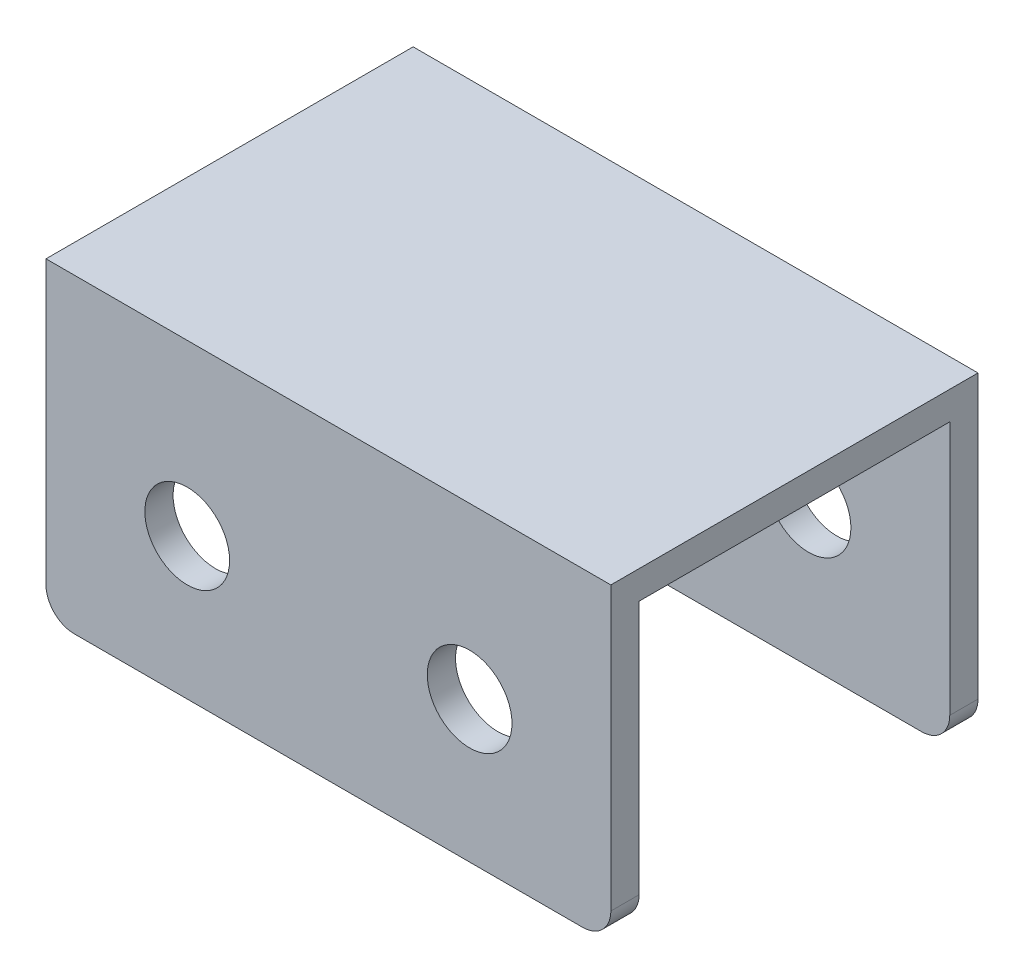
ISO-10303-21;
HEADER;
FILE_DESCRIPTION(('STEP AP214'),'2;1');
FILE_NAME('part.step','',(''),(''),'','','');
FILE_SCHEMA(('AUTOMOTIVE_DESIGN { 1 0 10303 214 1 1 1 1 }'));
ENDSEC;
DATA;
#1=APPLICATION_CONTEXT('core data for automotive mechanical design processes');
#2=APPLICATION_PROTOCOL_DEFINITION('international standard','automotive_design',2000,#1);
#3=PRODUCT_CONTEXT('',#1,'mechanical');
#4=PRODUCT('Part','Part','',(#3));
#5=PRODUCT_RELATED_PRODUCT_CATEGORY('part','',(#4));
#6=PRODUCT_DEFINITION_FORMATION('','',#4);
#7=PRODUCT_DEFINITION_CONTEXT('part definition',#1,'design');
#8=PRODUCT_DEFINITION('design','',#6,#7);
#9=PRODUCT_DEFINITION_SHAPE('','',#8);
#10=(LENGTH_UNIT() NAMED_UNIT(*) SI_UNIT(.MILLI.,.METRE.));
#11=(NAMED_UNIT(*) PLANE_ANGLE_UNIT() SI_UNIT($,.RADIAN.));
#12=(NAMED_UNIT(*) SI_UNIT($,.STERADIAN.) SOLID_ANGLE_UNIT());
#13=UNCERTAINTY_MEASURE_WITH_UNIT(LENGTH_MEASURE(1.E-05),#10,'distance_accuracy_value','');
#14=(GEOMETRIC_REPRESENTATION_CONTEXT(3) GLOBAL_UNCERTAINTY_ASSIGNED_CONTEXT((#13)) GLOBAL_UNIT_ASSIGNED_CONTEXT((#10,
#11,#12)) REPRESENTATION_CONTEXT('',''));
#15=CARTESIAN_POINT('',(0.,0.,0.));
#16=DIRECTION('',(0.,0.,1.));
#17=DIRECTION('',(1.,0.,0.));
#18=AXIS2_PLACEMENT_3D('',#15,#16,#17);
#19=CARTESIAN_POINT('',(50.,0.,-27.5));
#20=DIRECTION('',(0.,0.,-1.));
#21=DIRECTION('',(0.,1.,0.));
#22=AXIS2_PLACEMENT_3D('',#19,#20,#21);
#23=PLANE('',#22);
#24=CARTESIAN_POINT('',(25.,-25.,-27.5));
#25=DIRECTION('',(0.,0.,-1.));
#26=DIRECTION('',(0.,1.,0.));
#27=AXIS2_PLACEMENT_3D('',#24,#25,#26);
#28=CIRCLE('',#27,7.5);
#29=CARTESIAN_POINT('',(25.,-17.5,-27.5));
#30=VERTEX_POINT('',#29);
#31=EDGE_CURVE('E197',#30,#30,#28,.T.);
#32=ORIENTED_EDGE('',*,*,#31,.T.);
#33=EDGE_LOOP('',(#32));
#34=FACE_BOUND('',#33,.T.);
#35=CARTESIAN_POINT('',(-25.,-25.,-27.5));
#36=DIRECTION('',(0.,0.,-1.));
#37=DIRECTION('',(0.,1.,0.));
#38=AXIS2_PLACEMENT_3D('',#35,#36,#37);
#39=CIRCLE('',#38,7.5);
#40=CARTESIAN_POINT('',(-25.,-17.5,-27.5));
#41=VERTEX_POINT('',#40);
#42=EDGE_CURVE('E164',#41,#41,#39,.T.);
#43=ORIENTED_EDGE('',*,*,#42,.T.);
#44=EDGE_LOOP('',(#43));
#45=FACE_BOUND('',#44,.T.);
#46=DIRECTION('',(-1.,0.,0.));
#47=VECTOR('',#46,1.);
#48=CARTESIAN_POINT('',(50.,-50.,-27.5));
#49=LINE('',#48,#47);
#50=CARTESIAN_POINT('',(45.,-50.,-27.5));
#51=VERTEX_POINT('',#50);
#52=CARTESIAN_POINT('',(-45.,-50.,-27.5));
#53=VERTEX_POINT('',#52);
#54=EDGE_CURVE('E186',#51,#53,#49,.T.);
#55=ORIENTED_EDGE('',*,*,#54,.F.);
#56=CARTESIAN_POINT('',(45.,-45.,-27.5));
#57=DIRECTION('',(0.,0.,-1.));
#58=DIRECTION('',(0.,1.,0.));
#59=AXIS2_PLACEMENT_3D('',#56,#57,#58);
#60=CIRCLE('',#59,5.);
#61=CARTESIAN_POINT('',(50.,-45.,-27.5));
#62=VERTEX_POINT('',#61);
#63=EDGE_CURVE('E205',#51,#62,#60,.F.);
#64=ORIENTED_EDGE('',*,*,#63,.T.);
#65=DIRECTION('',(0.,-1.,0.));
#66=VECTOR('',#65,1.);
#67=CARTESIAN_POINT('',(50.,0.,-27.5));
#68=LINE('',#67,#66);
#69=CARTESIAN_POINT('',(50.,0.,-27.5));
#70=VERTEX_POINT('',#69);
#71=EDGE_CURVE('E146',#70,#62,#68,.T.);
#72=ORIENTED_EDGE('',*,*,#71,.F.);
#73=DIRECTION('',(-1.,0.,0.));
#74=VECTOR('',#73,1.);
#75=CARTESIAN_POINT('',(50.,0.,-27.5));
#76=LINE('',#75,#74);
#77=CARTESIAN_POINT('',(-50.,0.,-27.5));
#78=VERTEX_POINT('',#77);
#79=EDGE_CURVE('E160',#70,#78,#76,.T.);
#80=ORIENTED_EDGE('',*,*,#79,.T.);
#81=DIRECTION('',(0.,-1.,0.));
#82=VECTOR('',#81,1.);
#83=CARTESIAN_POINT('',(-50.,0.,-27.5));
#84=LINE('',#83,#82);
#85=CARTESIAN_POINT('',(-50.,-45.,-27.5));
#86=VERTEX_POINT('',#85);
#87=EDGE_CURVE('E161',#78,#86,#84,.T.);
#88=ORIENTED_EDGE('',*,*,#87,.T.);
#89=CARTESIAN_POINT('',(-45.,-45.,-27.5));
#90=DIRECTION('',(0.,0.,-1.));
#91=DIRECTION('',(0.,1.,0.));
#92=AXIS2_PLACEMENT_3D('',#89,#90,#91);
#93=CIRCLE('',#92,5.);
#94=EDGE_CURVE('E203',#86,#53,#93,.F.);
#95=ORIENTED_EDGE('',*,*,#94,.T.);
#96=EDGE_LOOP('',(#55,#64,#72,#80,#88,#95));
#97=FACE_BOUND('',#96,.T.);
#98=ADVANCED_FACE('F35',(#34,#45,#97),#23,.F.);
#99=CARTESIAN_POINT('',(50.,-50.,-32.5));
#100=DIRECTION('',(0.,-1.,0.));
#101=DIRECTION('',(0.,0.,-1.));
#102=AXIS2_PLACEMENT_3D('',#99,#100,#101);
#103=PLANE('',#102);
#104=DIRECTION('',(-1.,0.,0.));
#105=VECTOR('',#104,1.);
#106=CARTESIAN_POINT('',(50.,-50.,-32.5));
#107=LINE('',#106,#105);
#108=CARTESIAN_POINT('',(45.,-50.,-32.5));
#109=VERTEX_POINT('',#108);
#110=CARTESIAN_POINT('',(-45.,-50.,-32.5));
#111=VERTEX_POINT('',#110);
#112=EDGE_CURVE('E135',#109,#111,#107,.T.);
#113=ORIENTED_EDGE('',*,*,#112,.F.);
#114=DIRECTION('',(0.,0.,1.));
#115=VECTOR('',#114,1.);
#116=CARTESIAN_POINT('',(45.,-50.,-27.5));
#117=LINE('',#116,#115);
#118=EDGE_CURVE('E200',#109,#51,#117,.T.);
#119=ORIENTED_EDGE('',*,*,#118,.T.);
#120=ORIENTED_EDGE('',*,*,#54,.T.);
#121=DIRECTION('',(0.,0.,1.));
#122=VECTOR('',#121,1.);
#123=CARTESIAN_POINT('',(-45.,-50.,-32.5));
#124=LINE('',#123,#122);
#125=EDGE_CURVE('E189',#53,#111,#124,.F.);
#126=ORIENTED_EDGE('',*,*,#125,.T.);
#127=EDGE_LOOP('',(#113,#119,#120,#126));
#128=FACE_BOUND('',#127,.T.);
#129=ADVANCED_FACE('F257',(#128),#103,.T.);
#130=CARTESIAN_POINT('',(50.,0.,-32.5));
#131=DIRECTION('',(0.,0.,-1.));
#132=DIRECTION('',(0.,1.,0.));
#133=AXIS2_PLACEMENT_3D('',#130,#131,#132);
#134=PLANE('',#133);
#135=CARTESIAN_POINT('',(25.,-25.,-32.5));
#136=DIRECTION('',(0.,0.,1.));
#137=DIRECTION('',(1.,0.,0.));
#138=AXIS2_PLACEMENT_3D('',#135,#136,#137);
#139=CIRCLE('',#138,7.5);
#140=CARTESIAN_POINT('',(32.5,-25.,-32.5));
#141=VERTEX_POINT('',#140);
#142=EDGE_CURVE('E198',#141,#141,#139,.T.);
#143=ORIENTED_EDGE('',*,*,#142,.T.);
#144=EDGE_LOOP('',(#143));
#145=FACE_BOUND('',#144,.T.);
#146=CARTESIAN_POINT('',(-25.,-25.,-32.5));
#147=DIRECTION('',(0.,0.,1.));
#148=DIRECTION('',(1.,0.,0.));
#149=AXIS2_PLACEMENT_3D('',#146,#147,#148);
#150=CIRCLE('',#149,7.5);
#151=CARTESIAN_POINT('',(-17.5,-25.,-32.5));
#152=VERTEX_POINT('',#151);
#153=EDGE_CURVE('E193',#152,#152,#150,.T.);
#154=ORIENTED_EDGE('',*,*,#153,.T.);
#155=EDGE_LOOP('',(#154));
#156=FACE_BOUND('',#155,.T.);
#157=DIRECTION('',(0.,-1.,0.));
#158=VECTOR('',#157,1.);
#159=CARTESIAN_POINT('',(50.,0.,-32.5));
#160=LINE('',#159,#158);
#161=CARTESIAN_POINT('',(50.,5.,-32.5));
#162=VERTEX_POINT('',#161);
#163=CARTESIAN_POINT('',(50.,-45.,-32.5));
#164=VERTEX_POINT('',#163);
#165=EDGE_CURVE('E127',#162,#164,#160,.T.);
#166=ORIENTED_EDGE('',*,*,#165,.T.);
#167=CARTESIAN_POINT('',(45.,-45.,-32.5));
#168=DIRECTION('',(0.,0.,-1.));
#169=DIRECTION('',(0.,1.,0.));
#170=AXIS2_PLACEMENT_3D('',#167,#168,#169);
#171=CIRCLE('',#170,5.);
#172=EDGE_CURVE('E212',#164,#109,#171,.T.);
#173=ORIENTED_EDGE('',*,*,#172,.T.);
#174=ORIENTED_EDGE('',*,*,#112,.T.);
#175=CARTESIAN_POINT('',(-45.,-45.,-32.5));
#176=DIRECTION('',(0.,0.,-1.));
#177=DIRECTION('',(0.,1.,0.));
#178=AXIS2_PLACEMENT_3D('',#175,#176,#177);
#179=CIRCLE('',#178,5.);
#180=CARTESIAN_POINT('',(-50.,-45.,-32.5));
#181=VERTEX_POINT('',#180);
#182=EDGE_CURVE('E210',#111,#181,#179,.T.);
#183=ORIENTED_EDGE('',*,*,#182,.T.);
#184=DIRECTION('',(0.,-1.,0.));
#185=VECTOR('',#184,1.);
#186=CARTESIAN_POINT('',(-50.,0.,-32.5));
#187=LINE('',#186,#185);
#188=CARTESIAN_POINT('',(-50.,5.,-32.5));
#189=VERTEX_POINT('',#188);
#190=EDGE_CURVE('E130',#189,#181,#187,.T.);
#191=ORIENTED_EDGE('',*,*,#190,.F.);
#192=DIRECTION('',(-1.,0.,0.));
#193=VECTOR('',#192,1.);
#194=CARTESIAN_POINT('',(50.,5.,-32.5));
#195=LINE('',#194,#193);
#196=EDGE_CURVE('E124',#162,#189,#195,.T.);
#197=ORIENTED_EDGE('',*,*,#196,.F.);
#198=EDGE_LOOP('',(#166,#173,#174,#183,#191,#197));
#199=FACE_BOUND('',#198,.T.);
#200=ADVANCED_FACE('F126',(#145,#156,#199),#134,.T.);
#201=CARTESIAN_POINT('',(50.,5.,27.5));
#202=DIRECTION('',(0.,1.,0.));
#203=DIRECTION('',(0.,0.,1.));
#204=AXIS2_PLACEMENT_3D('',#201,#202,#203);
#205=PLANE('',#204);
#206=DIRECTION('',(0.,0.,-1.));
#207=VECTOR('',#206,1.);
#208=CARTESIAN_POINT('',(-50.,5.,27.5));
#209=LINE('',#208,#207);
#210=CARTESIAN_POINT('',(-50.,5.,32.5));
#211=VERTEX_POINT('',#210);
#212=EDGE_CURVE('E166',#211,#189,#209,.T.);
#213=ORIENTED_EDGE('',*,*,#212,.F.);
#214=DIRECTION('',(-1.,0.,0.));
#215=VECTOR('',#214,1.);
#216=CARTESIAN_POINT('',(50.,5.,32.5));
#217=LINE('',#216,#215);
#218=CARTESIAN_POINT('',(50.,5.,32.5));
#219=VERTEX_POINT('',#218);
#220=EDGE_CURVE('E136',#219,#211,#217,.T.);
#221=ORIENTED_EDGE('',*,*,#220,.F.);
#222=DIRECTION('',(0.,0.,-1.));
#223=VECTOR('',#222,1.);
#224=CARTESIAN_POINT('',(50.,5.,27.5));
#225=LINE('',#224,#223);
#226=EDGE_CURVE('E143',#219,#162,#225,.T.);
#227=ORIENTED_EDGE('',*,*,#226,.T.);
#228=ORIENTED_EDGE('',*,*,#196,.T.);
#229=EDGE_LOOP('',(#213,#221,#227,#228));
#230=FACE_BOUND('',#229,.T.);
#231=ADVANCED_FACE('F149',(#230),#205,.T.);
#232=CARTESIAN_POINT('',(50.,-50.,32.5));
#233=DIRECTION('',(0.,0.,1.));
#234=DIRECTION('',(0.,-1.,0.));
#235=AXIS2_PLACEMENT_3D('',#232,#233,#234);
#236=PLANE('',#235);
#237=CARTESIAN_POINT('',(25.,-25.,32.5));
#238=DIRECTION('',(0.,0.,1.));
#239=DIRECTION('',(1.,0.,0.));
#240=AXIS2_PLACEMENT_3D('',#237,#238,#239);
#241=CIRCLE('',#240,7.5);
#242=CARTESIAN_POINT('',(32.5,-25.,32.5));
#243=VERTEX_POINT('',#242);
#244=EDGE_CURVE('E295',#243,#243,#241,.T.);
#245=ORIENTED_EDGE('',*,*,#244,.F.);
#246=EDGE_LOOP('',(#245));
#247=FACE_BOUND('',#246,.T.);
#248=CARTESIAN_POINT('',(-25.,-25.,32.5));
#249=DIRECTION('',(0.,0.,1.));
#250=DIRECTION('',(1.,0.,0.));
#251=AXIS2_PLACEMENT_3D('',#248,#249,#250);
#252=CIRCLE('',#251,7.5);
#253=CARTESIAN_POINT('',(-17.5,-25.,32.5));
#254=VERTEX_POINT('',#253);
#255=EDGE_CURVE('E289',#254,#254,#252,.T.);
#256=ORIENTED_EDGE('',*,*,#255,.F.);
#257=EDGE_LOOP('',(#256));
#258=FACE_BOUND('',#257,.T.);
#259=DIRECTION('',(0.,1.,0.));
#260=VECTOR('',#259,1.);
#261=CARTESIAN_POINT('',(-50.,-50.,32.5));
#262=LINE('',#261,#260);
#263=CARTESIAN_POINT('',(-50.,-45.,32.5));
#264=VERTEX_POINT('',#263);
#265=EDGE_CURVE('E168',#264,#211,#262,.T.);
#266=ORIENTED_EDGE('',*,*,#265,.F.);
#267=CARTESIAN_POINT('',(-45.,-45.,32.5));
#268=DIRECTION('',(0.,0.,1.));
#269=DIRECTION('',(0.,-1.,0.));
#270=AXIS2_PLACEMENT_3D('',#267,#268,#269);
#271=CIRCLE('',#270,5.);
#272=CARTESIAN_POINT('',(-45.,-50.,32.5));
#273=VERTEX_POINT('',#272);
#274=EDGE_CURVE('E222',#264,#273,#271,.T.);
#275=ORIENTED_EDGE('',*,*,#274,.T.);
#276=DIRECTION('',(-1.,0.,0.));
#277=VECTOR('',#276,1.);
#278=CARTESIAN_POINT('',(50.,-50.,32.5));
#279=LINE('',#278,#277);
#280=CARTESIAN_POINT('',(45.,-50.,32.5));
#281=VERTEX_POINT('',#280);
#282=EDGE_CURVE('E181',#281,#273,#279,.T.);
#283=ORIENTED_EDGE('',*,*,#282,.F.);
#284=CARTESIAN_POINT('',(45.,-45.,32.5));
#285=DIRECTION('',(0.,0.,1.));
#286=DIRECTION('',(0.,-1.,0.));
#287=AXIS2_PLACEMENT_3D('',#284,#285,#286);
#288=CIRCLE('',#287,5.);
#289=CARTESIAN_POINT('',(50.,-45.,32.5));
#290=VERTEX_POINT('',#289);
#291=EDGE_CURVE('E220',#281,#290,#288,.T.);
#292=ORIENTED_EDGE('',*,*,#291,.T.);
#293=DIRECTION('',(0.,1.,0.));
#294=VECTOR('',#293,1.);
#295=CARTESIAN_POINT('',(50.,-50.,32.5));
#296=LINE('',#295,#294);
#297=EDGE_CURVE('E151',#290,#219,#296,.T.);
#298=ORIENTED_EDGE('',*,*,#297,.T.);
#299=ORIENTED_EDGE('',*,*,#220,.T.);
#300=EDGE_LOOP('',(#266,#275,#283,#292,#298,#299));
#301=FACE_BOUND('',#300,.T.);
#302=ADVANCED_FACE('F233',(#247,#258,#301),#236,.T.);
#303=CARTESIAN_POINT('',(50.,-50.,27.5));
#304=DIRECTION('',(0.,-1.,0.));
#305=DIRECTION('',(0.,0.,-1.));
#306=AXIS2_PLACEMENT_3D('',#303,#304,#305);
#307=PLANE('',#306);
#308=ORIENTED_EDGE('',*,*,#282,.T.);
#309=DIRECTION('',(0.,0.,1.));
#310=VECTOR('',#309,1.);
#311=CARTESIAN_POINT('',(-45.,-50.,27.5));
#312=LINE('',#311,#310);
#313=CARTESIAN_POINT('',(-45.,-50.,27.5));
#314=VERTEX_POINT('',#313);
#315=EDGE_CURVE('E50',#273,#314,#312,.F.);
#316=ORIENTED_EDGE('',*,*,#315,.T.);
#317=DIRECTION('',(-1.,0.,0.));
#318=VECTOR('',#317,1.);
#319=CARTESIAN_POINT('',(50.,-50.,27.5));
#320=LINE('',#319,#318);
#321=CARTESIAN_POINT('',(45.,-50.,27.5));
#322=VERTEX_POINT('',#321);
#323=EDGE_CURVE('E179',#322,#314,#320,.T.);
#324=ORIENTED_EDGE('',*,*,#323,.F.);
#325=DIRECTION('',(0.,0.,1.));
#326=VECTOR('',#325,1.);
#327=CARTESIAN_POINT('',(45.,-50.,32.5));
#328=LINE('',#327,#326);
#329=EDGE_CURVE('E224',#322,#281,#328,.T.);
#330=ORIENTED_EDGE('',*,*,#329,.T.);
#331=EDGE_LOOP('',(#308,#316,#324,#330));
#332=FACE_BOUND('',#331,.T.);
#333=ADVANCED_FACE('F229',(#332),#307,.T.);
#334=CARTESIAN_POINT('',(50.,-50.,27.5));
#335=DIRECTION('',(0.,0.,1.));
#336=DIRECTION('',(0.,-1.,0.));
#337=AXIS2_PLACEMENT_3D('',#334,#335,#336);
#338=PLANE('',#337);
#339=CARTESIAN_POINT('',(25.,-25.,27.5));
#340=DIRECTION('',(0.,0.,1.));
#341=DIRECTION('',(0.,-1.,0.));
#342=AXIS2_PLACEMENT_3D('',#339,#340,#341);
#343=CIRCLE('',#342,7.5);
#344=CARTESIAN_POINT('',(25.,-32.5,27.5));
#345=VERTEX_POINT('',#344);
#346=EDGE_CURVE('E194',#345,#345,#343,.T.);
#347=ORIENTED_EDGE('',*,*,#346,.T.);
#348=EDGE_LOOP('',(#347));
#349=FACE_BOUND('',#348,.T.);
#350=CARTESIAN_POINT('',(-25.,-25.,27.5));
#351=DIRECTION('',(0.,0.,1.));
#352=DIRECTION('',(0.,-1.,0.));
#353=AXIS2_PLACEMENT_3D('',#350,#351,#352);
#354=CIRCLE('',#353,7.5);
#355=CARTESIAN_POINT('',(-25.,-32.5,27.5));
#356=VERTEX_POINT('',#355);
#357=EDGE_CURVE('E190',#356,#356,#354,.T.);
#358=ORIENTED_EDGE('',*,*,#357,.T.);
#359=EDGE_LOOP('',(#358));
#360=FACE_BOUND('',#359,.T.);
#361=ORIENTED_EDGE('',*,*,#323,.T.);
#362=CARTESIAN_POINT('',(-45.,-45.,27.5));
#363=DIRECTION('',(0.,0.,1.));
#364=DIRECTION('',(0.,-1.,0.));
#365=AXIS2_PLACEMENT_3D('',#362,#363,#364);
#366=CIRCLE('',#365,5.);
#367=CARTESIAN_POINT('',(-50.,-45.,27.5));
#368=VERTEX_POINT('',#367);
#369=EDGE_CURVE('E11',#314,#368,#366,.F.);
#370=ORIENTED_EDGE('',*,*,#369,.T.);
#371=DIRECTION('',(0.,1.,0.));
#372=VECTOR('',#371,1.);
#373=CARTESIAN_POINT('',(-50.,-50.,27.5));
#374=LINE('',#373,#372);
#375=CARTESIAN_POINT('',(-50.,0.,27.5));
#376=VERTEX_POINT('',#375);
#377=EDGE_CURVE('E170',#368,#376,#374,.T.);
#378=ORIENTED_EDGE('',*,*,#377,.T.);
#379=DIRECTION('',(-1.,0.,0.));
#380=VECTOR('',#379,1.);
#381=CARTESIAN_POINT('',(50.,0.,27.5));
#382=LINE('',#381,#380);
#383=CARTESIAN_POINT('',(50.,0.,27.5));
#384=VERTEX_POINT('',#383);
#385=EDGE_CURVE('E176',#384,#376,#382,.T.);
#386=ORIENTED_EDGE('',*,*,#385,.F.);
#387=DIRECTION('',(0.,1.,0.));
#388=VECTOR('',#387,1.);
#389=CARTESIAN_POINT('',(50.,-50.,27.5));
#390=LINE('',#389,#388);
#391=CARTESIAN_POINT('',(50.,-45.,27.5));
#392=VERTEX_POINT('',#391);
#393=EDGE_CURVE('E153',#392,#384,#390,.T.);
#394=ORIENTED_EDGE('',*,*,#393,.F.);
#395=CARTESIAN_POINT('',(45.,-45.,27.5));
#396=DIRECTION('',(0.,0.,1.));
#397=DIRECTION('',(0.,-1.,0.));
#398=AXIS2_PLACEMENT_3D('',#395,#396,#397);
#399=CIRCLE('',#398,5.);
#400=EDGE_CURVE('E43',#392,#322,#399,.F.);
#401=ORIENTED_EDGE('',*,*,#400,.T.);
#402=EDGE_LOOP('',(#361,#370,#378,#386,#394,#401));
#403=FACE_BOUND('',#402,.T.);
#404=ADVANCED_FACE('F244',(#349,#360,#403),#338,.F.);
#405=CARTESIAN_POINT('',(50.,0.,27.5));
#406=DIRECTION('',(0.,1.,0.));
#407=DIRECTION('',(0.,0.,1.));
#408=AXIS2_PLACEMENT_3D('',#405,#406,#407);
#409=PLANE('',#408);
#410=DIRECTION('',(0.,0.,-1.));
#411=VECTOR('',#410,1.);
#412=CARTESIAN_POINT('',(-50.,0.,27.5));
#413=LINE('',#412,#411);
#414=EDGE_CURVE('E172',#376,#78,#413,.T.);
#415=ORIENTED_EDGE('',*,*,#414,.T.);
#416=ORIENTED_EDGE('',*,*,#79,.F.);
#417=DIRECTION('',(0.,0.,-1.));
#418=VECTOR('',#417,1.);
#419=CARTESIAN_POINT('',(50.,0.,27.5));
#420=LINE('',#419,#418);
#421=EDGE_CURVE('E158',#384,#70,#420,.T.);
#422=ORIENTED_EDGE('',*,*,#421,.F.);
#423=ORIENTED_EDGE('',*,*,#385,.T.);
#424=EDGE_LOOP('',(#415,#416,#422,#423));
#425=FACE_BOUND('',#424,.T.);
#426=ADVANCED_FACE('F247',(#425),#409,.F.);
#427=CARTESIAN_POINT('',(50.,0.,0.));
#428=DIRECTION('',(-1.,0.,0.));
#429=DIRECTION('',(0.,0.,1.));
#430=AXIS2_PLACEMENT_3D('',#427,#428,#429);
#431=PLANE('',#430);
#432=ORIENTED_EDGE('',*,*,#71,.T.);
#433=DIRECTION('',(0.,0.,1.));
#434=VECTOR('',#433,1.);
#435=CARTESIAN_POINT('',(50.,-45.,-32.5));
#436=LINE('',#435,#434);
#437=EDGE_CURVE('E145',#62,#164,#436,.F.);
#438=ORIENTED_EDGE('',*,*,#437,.T.);
#439=ORIENTED_EDGE('',*,*,#165,.F.);
#440=ORIENTED_EDGE('',*,*,#226,.F.);
#441=ORIENTED_EDGE('',*,*,#297,.F.);
#442=DIRECTION('',(0.,0.,1.));
#443=VECTOR('',#442,1.);
#444=CARTESIAN_POINT('',(50.,-45.,27.5));
#445=LINE('',#444,#443);
#446=EDGE_CURVE('E207',#290,#392,#445,.F.);
#447=ORIENTED_EDGE('',*,*,#446,.T.);
#448=ORIENTED_EDGE('',*,*,#393,.T.);
#449=ORIENTED_EDGE('',*,*,#421,.T.);
#450=EDGE_LOOP('',(#432,#438,#439,#440,#441,#447,#448,#449));
#451=FACE_BOUND('',#450,.T.);
#452=ADVANCED_FACE('F141',(#451),#431,.F.);
#453=CARTESIAN_POINT('',(-50.,0.,0.));
#454=DIRECTION('',(-1.,0.,0.));
#455=DIRECTION('',(0.,0.,1.));
#456=AXIS2_PLACEMENT_3D('',#453,#454,#455);
#457=PLANE('',#456);
#458=ORIENTED_EDGE('',*,*,#190,.T.);
#459=DIRECTION('',(0.,0.,1.));
#460=VECTOR('',#459,1.);
#461=CARTESIAN_POINT('',(-50.,-45.,0.));
#462=LINE('',#461,#460);
#463=EDGE_CURVE('E217',#181,#86,#462,.T.);
#464=ORIENTED_EDGE('',*,*,#463,.T.);
#465=ORIENTED_EDGE('',*,*,#87,.F.);
#466=ORIENTED_EDGE('',*,*,#414,.F.);
#467=ORIENTED_EDGE('',*,*,#377,.F.);
#468=DIRECTION('',(0.,0.,1.));
#469=VECTOR('',#468,1.);
#470=CARTESIAN_POINT('',(-50.,-45.,0.));
#471=LINE('',#470,#469);
#472=EDGE_CURVE('E214',#368,#264,#471,.T.);
#473=ORIENTED_EDGE('',*,*,#472,.T.);
#474=ORIENTED_EDGE('',*,*,#265,.T.);
#475=ORIENTED_EDGE('',*,*,#212,.T.);
#476=EDGE_LOOP('',(#458,#464,#465,#466,#467,#473,#474,#475));
#477=FACE_BOUND('',#476,.T.);
#478=ADVANCED_FACE('F240',(#477),#457,.T.);
#479=CARTESIAN_POINT('',(-25.,-25.,-32.5));
#480=DIRECTION('',(0.,0.,1.));
#481=DIRECTION('',(1.,0.,0.));
#482=AXIS2_PLACEMENT_3D('',#479,#480,#481);
#483=CYLINDRICAL_SURFACE('',#482,7.5);
#484=ORIENTED_EDGE('',*,*,#255,.T.);
#485=EDGE_LOOP('',(#484));
#486=FACE_BOUND('',#485,.T.);
#487=ORIENTED_EDGE('',*,*,#357,.F.);
#488=EDGE_LOOP('',(#487));
#489=FACE_BOUND('',#488,.T.);
#490=ADVANCED_FACE('F307',(#486,#489),#483,.F.);
#491=ORIENTED_EDGE('',*,*,#153,.F.);
#492=EDGE_LOOP('',(#491));
#493=FACE_BOUND('',#492,.T.);
#494=ORIENTED_EDGE('',*,*,#42,.F.);
#495=EDGE_LOOP('',(#494));
#496=FACE_BOUND('',#495,.T.);
#497=ADVANCED_FACE('F310',(#493,#496),#483,.F.);
#498=CARTESIAN_POINT('',(25.,-25.,-32.5));
#499=DIRECTION('',(0.,0.,1.));
#500=DIRECTION('',(1.,0.,0.));
#501=AXIS2_PLACEMENT_3D('',#498,#499,#500);
#502=CYLINDRICAL_SURFACE('',#501,7.5);
#503=ORIENTED_EDGE('',*,*,#244,.T.);
#504=EDGE_LOOP('',(#503));
#505=FACE_BOUND('',#504,.T.);
#506=ORIENTED_EDGE('',*,*,#346,.F.);
#507=EDGE_LOOP('',(#506));
#508=FACE_BOUND('',#507,.T.);
#509=ADVANCED_FACE('F299',(#505,#508),#502,.F.);
#510=ORIENTED_EDGE('',*,*,#142,.F.);
#511=EDGE_LOOP('',(#510));
#512=FACE_BOUND('',#511,.T.);
#513=ORIENTED_EDGE('',*,*,#31,.F.);
#514=EDGE_LOOP('',(#513));
#515=FACE_BOUND('',#514,.T.);
#516=ADVANCED_FACE('F272',(#512,#515),#502,.F.);
#517=CARTESIAN_POINT('',(45.,-45.,-32.5));
#518=DIRECTION('',(0.,0.,-1.));
#519=DIRECTION('',(-1.,0.,0.));
#520=AXIS2_PLACEMENT_3D('',#517,#518,#519);
#521=CYLINDRICAL_SURFACE('',#520,5.);
#522=ORIENTED_EDGE('',*,*,#172,.F.);
#523=ORIENTED_EDGE('',*,*,#437,.F.);
#524=ORIENTED_EDGE('',*,*,#63,.F.);
#525=ORIENTED_EDGE('',*,*,#118,.F.);
#526=EDGE_LOOP('',(#522,#523,#524,#525));
#527=FACE_BOUND('',#526,.T.);
#528=ADVANCED_FACE('F269',(#527),#521,.T.);
#529=CARTESIAN_POINT('',(-45.,-45.,0.));
#530=DIRECTION('',(0.,0.,1.));
#531=DIRECTION('',(1.,0.,0.));
#532=AXIS2_PLACEMENT_3D('',#529,#530,#531);
#533=CYLINDRICAL_SURFACE('',#532,5.);
#534=ORIENTED_EDGE('',*,*,#182,.F.);
#535=ORIENTED_EDGE('',*,*,#125,.F.);
#536=ORIENTED_EDGE('',*,*,#94,.F.);
#537=ORIENTED_EDGE('',*,*,#463,.F.);
#538=EDGE_LOOP('',(#534,#535,#536,#537));
#539=FACE_BOUND('',#538,.T.);
#540=ADVANCED_FACE('F255',(#539),#533,.T.);
#541=CARTESIAN_POINT('',(-45.,-45.,0.));
#542=DIRECTION('',(0.,0.,1.));
#543=DIRECTION('',(1.,0.,0.));
#544=AXIS2_PLACEMENT_3D('',#541,#542,#543);
#545=CYLINDRICAL_SURFACE('',#544,5.);
#546=ORIENTED_EDGE('',*,*,#369,.F.);
#547=ORIENTED_EDGE('',*,*,#315,.F.);
#548=ORIENTED_EDGE('',*,*,#274,.F.);
#549=ORIENTED_EDGE('',*,*,#472,.F.);
#550=EDGE_LOOP('',(#546,#547,#548,#549));
#551=FACE_BOUND('',#550,.T.);
#552=ADVANCED_FACE('F237',(#551),#545,.T.);
#553=CARTESIAN_POINT('',(45.,-45.,27.5));
#554=DIRECTION('',(0.,0.,-1.));
#555=DIRECTION('',(-1.,0.,0.));
#556=AXIS2_PLACEMENT_3D('',#553,#554,#555);
#557=CYLINDRICAL_SURFACE('',#556,5.);
#558=ORIENTED_EDGE('',*,*,#400,.F.);
#559=ORIENTED_EDGE('',*,*,#446,.F.);
#560=ORIENTED_EDGE('',*,*,#291,.F.);
#561=ORIENTED_EDGE('',*,*,#329,.F.);
#562=EDGE_LOOP('',(#558,#559,#560,#561));
#563=FACE_BOUND('',#562,.T.);
#564=ADVANCED_FACE('F37',(#563),#557,.T.);
#565=CLOSED_SHELL('',(#98,#129,#200,#231,#302,#333,#404,#426,#452,#478,#490,#497,#509,#516,#528,
#540,#552,#564));
#566=MANIFOLD_SOLID_BREP('B2',#565);
#567=ADVANCED_BREP_SHAPE_REPRESENTATION('',(#18,#566),#14);
#568=SHAPE_DEFINITION_REPRESENTATION(#9,#567);
ENDSEC;
END-ISO-10303-21;
